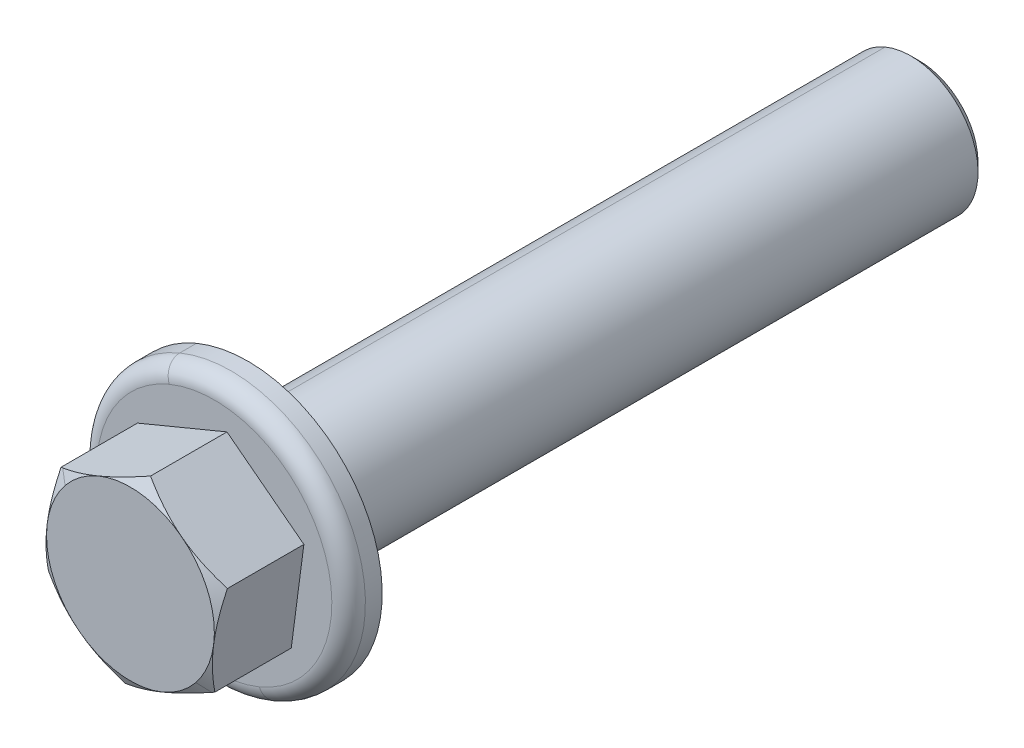
ISO-10303-21;
HEADER;
FILE_DESCRIPTION(('STEP AP214'),'2;1');
FILE_NAME('part.step','',(''),(''),'','','');
FILE_SCHEMA(('AUTOMOTIVE_DESIGN { 1 0 10303 214 1 1 1 1 }'));
ENDSEC;
DATA;
#1=APPLICATION_CONTEXT('core data for automotive mechanical design processes');
#2=APPLICATION_PROTOCOL_DEFINITION('international standard','automotive_design',2000,#1);
#3=PRODUCT_CONTEXT('',#1,'mechanical');
#4=PRODUCT('Part','Part','',(#3));
#5=PRODUCT_RELATED_PRODUCT_CATEGORY('part','',(#4));
#6=PRODUCT_DEFINITION_FORMATION('','',#4);
#7=PRODUCT_DEFINITION_CONTEXT('part definition',#1,'design');
#8=PRODUCT_DEFINITION('design','',#6,#7);
#9=PRODUCT_DEFINITION_SHAPE('','',#8);
#10=(LENGTH_UNIT() NAMED_UNIT(*) SI_UNIT(.MILLI.,.METRE.));
#11=(NAMED_UNIT(*) PLANE_ANGLE_UNIT() SI_UNIT($,.RADIAN.));
#12=(NAMED_UNIT(*) SI_UNIT($,.STERADIAN.) SOLID_ANGLE_UNIT());
#13=UNCERTAINTY_MEASURE_WITH_UNIT(LENGTH_MEASURE(1.E-05),#10,'distance_accuracy_value','');
#14=(GEOMETRIC_REPRESENTATION_CONTEXT(3) GLOBAL_UNCERTAINTY_ASSIGNED_CONTEXT((#13)) GLOBAL_UNIT_ASSIGNED_CONTEXT((#10,
#11,#12)) REPRESENTATION_CONTEXT('',''));
#15=CARTESIAN_POINT('',(0.,0.,0.));
#16=DIRECTION('',(0.,0.,1.));
#17=DIRECTION('',(1.,0.,0.));
#18=AXIS2_PLACEMENT_3D('',#15,#16,#17);
#19=CARTESIAN_POINT('',(-114.,-28.,24.3));
#20=DIRECTION('',(0.,0.,1.));
#21=DIRECTION('',(0.923728021347068,0.383049008063238,0.));
#22=AXIS2_PLACEMENT_3D('',#19,#20,#21);
#23=TOROIDAL_SURFACE('',#22,4.25,0.25);
#24=CARTESIAN_POINT('',(-114.,-28.,24.55));
#25=DIRECTION('',(0.,0.,-1.));
#26=DIRECTION('',(-0.923728021347068,-0.383049008063239,0.));
#27=AXIS2_PLACEMENT_3D('',#24,#25,#26);
#28=CIRCLE('',#27,4.25);
#29=CARTESIAN_POINT('',(-112.372041715731,-31.9258440907251,24.55));
#30=VERTEX_POINT('',#29);
#31=CARTESIAN_POINT('',(-115.627958284269,-24.074155909275,24.55));
#32=VERTEX_POINT('',#31);
#33=EDGE_CURVE('E11',#30,#32,#28,.T.);
#34=ORIENTED_EDGE('',*,*,#33,.T.);
#35=CARTESIAN_POINT('',(-115.627958284269,-24.074155909275,24.3));
#36=DIRECTION('',(0.923728021347068,0.383049008063238,0.));
#37=DIRECTION('',(0.,0.,1.));
#38=AXIS2_PLACEMENT_3D('',#35,#36,#37);
#39=CIRCLE('',#38,0.25);
#40=CARTESIAN_POINT('',(-115.532196032253,-24.3050879146118,24.3));
#41=VERTEX_POINT('',#40);
#42=EDGE_CURVE('E33',#32,#41,#39,.T.);
#43=ORIENTED_EDGE('',*,*,#42,.T.);
#44=CARTESIAN_POINT('',(-114.,-28.,24.3));
#45=DIRECTION('',(0.,0.,-1.));
#46=DIRECTION('',(-0.923728021347068,-0.383049008063238,0.));
#47=AXIS2_PLACEMENT_3D('',#44,#45,#46);
#48=CIRCLE('',#47,4.);
#49=CARTESIAN_POINT('',(-112.467803967747,-31.6949120853883,24.3));
#50=VERTEX_POINT('',#49);
#51=EDGE_CURVE('E461',#50,#41,#48,.T.);
#52=ORIENTED_EDGE('',*,*,#51,.F.);
#53=CARTESIAN_POINT('',(-112.372041715731,-31.9258440907251,24.3));
#54=DIRECTION('',(-0.923728021347068,-0.383049008063238,0.));
#55=DIRECTION('',(0.,0.,1.));
#56=AXIS2_PLACEMENT_3D('',#53,#54,#55);
#57=CIRCLE('',#56,0.25);
#58=EDGE_CURVE('E457',#30,#50,#57,.T.);
#59=ORIENTED_EDGE('',*,*,#58,.F.);
#60=EDGE_LOOP('',(#34,#43,#52,#59));
#61=FACE_BOUND('',#60,.T.);
#62=ADVANCED_FACE('F17',(#61),#23,.F.);
#63=CARTESIAN_POINT('',(-114.,-28.,24.3));
#64=DIRECTION('',(0.,0.,1.));
#65=DIRECTION('',(-0.383049008063238,0.923728021347068,0.));
#66=AXIS2_PLACEMENT_3D('',#63,#64,#65);
#67=TOROIDAL_SURFACE('',#66,4.25,0.25);
#68=CARTESIAN_POINT('',(-114.,-28.,24.55));
#69=DIRECTION('',(0.,0.,-1.));
#70=DIRECTION('',(-0.923728021347068,-0.383049008063239,0.));
#71=AXIS2_PLACEMENT_3D('',#68,#69,#70);
#72=CIRCLE('',#71,4.25);
#73=EDGE_CURVE('E454',#32,#30,#72,.T.);
#74=ORIENTED_EDGE('',*,*,#73,.T.);
#75=ORIENTED_EDGE('',*,*,#58,.T.);
#76=CARTESIAN_POINT('',(-114.,-28.,24.3));
#77=DIRECTION('',(0.,0.,-1.));
#78=DIRECTION('',(-0.923728021347068,-0.383049008063238,0.));
#79=AXIS2_PLACEMENT_3D('',#76,#77,#78);
#80=CIRCLE('',#79,4.);
#81=EDGE_CURVE('E465',#41,#50,#80,.T.);
#82=ORIENTED_EDGE('',*,*,#81,.F.);
#83=ORIENTED_EDGE('',*,*,#42,.F.);
#84=EDGE_LOOP('',(#74,#75,#82,#83));
#85=FACE_BOUND('',#84,.T.);
#86=ADVANCED_FACE('F311',(#85),#67,.F.);
#87=CARTESIAN_POINT('',(-114.,-28.,4.55));
#88=DIRECTION('',(0.,0.,1.));
#89=DIRECTION('',(0.923728021347068,0.383049008063238,0.));
#90=AXIS2_PLACEMENT_3D('',#87,#88,#89);
#91=CYLINDRICAL_SURFACE('',#90,4.);
#92=DIRECTION('',(0.,0.,-1.));
#93=VECTOR('',#92,1.);
#94=CARTESIAN_POINT('',(-112.467803967747,-31.6949120853883,4.55));
#95=LINE('',#94,#93);
#96=CARTESIAN_POINT('',(-112.467803967747,-31.6949120853883,-14.95));
#97=VERTEX_POINT('',#96);
#98=EDGE_CURVE('E468',#50,#97,#95,.T.);
#99=ORIENTED_EDGE('',*,*,#98,.F.);
#100=ORIENTED_EDGE('',*,*,#51,.T.);
#101=DIRECTION('',(0.,0.,-1.));
#102=VECTOR('',#101,1.);
#103=CARTESIAN_POINT('',(-115.532196032253,-24.3050879146118,4.55));
#104=LINE('',#103,#102);
#105=CARTESIAN_POINT('',(-115.532196032253,-24.3050879146118,-14.95));
#106=VERTEX_POINT('',#105);
#107=EDGE_CURVE('E472',#41,#106,#104,.T.);
#108=ORIENTED_EDGE('',*,*,#107,.T.);
#109=CARTESIAN_POINT('',(-114.,-28.,-14.95));
#110=DIRECTION('',(0.,0.,1.));
#111=DIRECTION('',(-0.923728021347068,-0.383049008063238,0.));
#112=AXIS2_PLACEMENT_3D('',#109,#110,#111);
#113=CIRCLE('',#112,4.);
#114=EDGE_CURVE('E467',#106,#97,#113,.T.);
#115=ORIENTED_EDGE('',*,*,#114,.T.);
#116=EDGE_LOOP('',(#99,#100,#108,#115));
#117=FACE_BOUND('',#116,.T.);
#118=ADVANCED_FACE('F317',(#117),#91,.T.);
#119=CARTESIAN_POINT('',(-114.,-28.,4.55));
#120=DIRECTION('',(0.,0.,1.));
#121=DIRECTION('',(0.923728021347068,0.383049008063238,0.));
#122=AXIS2_PLACEMENT_3D('',#119,#120,#121);
#123=CYLINDRICAL_SURFACE('',#122,4.);
#124=ORIENTED_EDGE('',*,*,#107,.F.);
#125=ORIENTED_EDGE('',*,*,#81,.T.);
#126=ORIENTED_EDGE('',*,*,#98,.T.);
#127=CARTESIAN_POINT('',(-114.,-28.,-14.95));
#128=DIRECTION('',(0.,0.,1.));
#129=DIRECTION('',(-0.923728021347068,-0.383049008063238,0.));
#130=AXIS2_PLACEMENT_3D('',#127,#128,#129);
#131=CIRCLE('',#130,4.);
#132=EDGE_CURVE('E471',#97,#106,#131,.T.);
#133=ORIENTED_EDGE('',*,*,#132,.T.);
#134=EDGE_LOOP('',(#124,#125,#126,#133));
#135=FACE_BOUND('',#134,.T.);
#136=ADVANCED_FACE('F322',(#135),#123,.T.);
#137=CARTESIAN_POINT('',(-114.,-28.,-18.95));
#138=DIRECTION('',(0.,0.,1.));
#139=DIRECTION('',(-0.114958388351689,0.993370308066223,0.));
#140=AXIS2_PLACEMENT_3D('',#137,#138,#139);
#141=CONICAL_SURFACE('',#140,0.,0.785398163396999);
#142=DIRECTION('',(0.270856393052956,-0.653174413416782,-0.707106781186537));
#143=VECTOR('',#142,1.);
#144=CARTESIAN_POINT('',(-115.436432941916,-24.5360195723158,-15.2));
#145=LINE('',#144,#143);
#146=CARTESIAN_POINT('',(-115.340671286211,-24.7669518249291,-15.45));
#147=VERTEX_POINT('',#146);
#148=EDGE_CURVE('E478',#106,#147,#145,.T.);
#149=ORIENTED_EDGE('',*,*,#148,.T.);
#150=CARTESIAN_POINT('',(-114.,-28.,-15.45));
#151=DIRECTION('',(0.,0.,1.));
#152=DIRECTION('',(0.993370308066188,0.114958388351986,0.));
#153=AXIS2_PLACEMENT_3D('',#150,#151,#152);
#154=CIRCLE('',#153,3.5);
#155=CARTESIAN_POINT('',(-112.659328471779,-31.2330480747147,-15.45));
#156=VERTEX_POINT('',#155);
#157=EDGE_CURVE('E481',#147,#156,#154,.T.);
#158=ORIENTED_EDGE('',*,*,#157,.T.);
#159=DIRECTION('',(-0.270856551128283,0.65317434786655,-0.707106781186547));
#160=VECTOR('',#159,1.);
#161=CARTESIAN_POINT('',(-112.563566219763,-31.4639800800515,-15.2));
#162=LINE('',#161,#160);
#163=EDGE_CURVE('E484',#97,#156,#162,.T.);
#164=ORIENTED_EDGE('',*,*,#163,.F.);
#165=ORIENTED_EDGE('',*,*,#114,.F.);
#166=EDGE_LOOP('',(#149,#158,#164,#165));
#167=FACE_BOUND('',#166,.T.);
#168=ADVANCED_FACE('F326',(#167),#141,.T.);
#169=CARTESIAN_POINT('',(-114.,-27.9999999999988,-18.95));
#170=DIRECTION('',(-2.07112037355488E-13,-2.99341000002082E-13,1.));
#171=DIRECTION('',(0.383049008063238,-0.923728021347068,-1.97175609173E-13));
#172=AXIS2_PLACEMENT_3D('',#169,#170,#171);
#173=CONICAL_SURFACE('',#172,0.,0.785398163396999);
#174=ORIENTED_EDGE('',*,*,#163,.T.);
#175=CARTESIAN_POINT('',(-114.,-28.,-15.4499999999993));
#176=DIRECTION('',(-2.8263995886347E-13,-1.17204364682804E-13,1.));
#177=DIRECTION('',(0.923728021347068,0.383049008063238,3.05977465587E-13));
#178=AXIS2_PLACEMENT_3D('',#175,#176,#177);
#179=CIRCLE('',#178,3.5);
#180=EDGE_CURVE('E352',#156,#147,#179,.T.);
#181=ORIENTED_EDGE('',*,*,#180,.T.);
#182=ORIENTED_EDGE('',*,*,#148,.F.);
#183=ORIENTED_EDGE('',*,*,#132,.F.);
#184=EDGE_LOOP('',(#174,#181,#182,#183));
#185=FACE_BOUND('',#184,.T.);
#186=ADVANCED_FACE('F330',(#185),#173,.T.);
#187=CARTESIAN_POINT('',(-114.,-28.,-15.45));
#188=DIRECTION('',(0.,0.,1.));
#189=DIRECTION('',(-0.383049008063238,0.923728021347068,0.));
#190=AXIS2_PLACEMENT_3D('',#187,#188,#189);
#191=PLANE('',#190);
#192=ORIENTED_EDGE('',*,*,#180,.F.);
#193=ORIENTED_EDGE('',*,*,#157,.F.);
#194=EDGE_LOOP('',(#192,#193));
#195=FACE_BOUND('',#194,.T.);
#196=ADVANCED_FACE('F334',(#195),#191,.F.);
#197=CARTESIAN_POINT('',(-114.,-28.,31.55));
#198=DIRECTION('',(0.,0.,1.));
#199=DIRECTION('',(0.923728021347068,0.383049008063238,0.));
#200=AXIS2_PLACEMENT_3D('',#197,#198,#199);
#201=PLANE('',#200);
#202=CARTESIAN_POINT('',(-114.,-28.,31.55));
#203=DIRECTION('',(0.,0.,1.));
#204=DIRECTION('',(-0.923728021347068,-0.383049008063239,0.));
#205=AXIS2_PLACEMENT_3D('',#202,#203,#204);
#206=CIRCLE('',#205,5.);
#207=CARTESIAN_POINT('',(-109.04251781647,-28.650669193983,31.5499999999993));
#208=VERTEX_POINT('',#207);
#209=CARTESIAN_POINT('',(-110.957762856788,-24.0320290872444,31.5499999999992));
#210=VERTEX_POINT('',#209);
#211=EDGE_CURVE('E347',#208,#210,#206,.T.);
#212=ORIENTED_EDGE('',*,*,#211,.T.);
#213=CARTESIAN_POINT('',(-114.,-28.,31.55));
#214=DIRECTION('',(0.,0.,1.));
#215=DIRECTION('',(-0.923728021347068,-0.383049008063239,0.));
#216=AXIS2_PLACEMENT_3D('',#213,#214,#215);
#217=CIRCLE('',#216,5.);
#218=CARTESIAN_POINT('',(-115.915245040316,-23.3813598932646,31.55));
#219=VERTEX_POINT('',#218);
#220=EDGE_CURVE('E353',#210,#219,#217,.T.);
#221=ORIENTED_EDGE('',*,*,#220,.T.);
#222=CARTESIAN_POINT('',(-114.,-28.,31.55));
#223=DIRECTION('',(0.,0.,1.));
#224=DIRECTION('',(-0.923728021347068,-0.383049008063239,0.));
#225=AXIS2_PLACEMENT_3D('',#222,#223,#224);
#226=CIRCLE('',#225,5.);
#227=CARTESIAN_POINT('',(-117.895079669917,-24.8649793676956,31.55));
#228=VERTEX_POINT('',#227);
#229=EDGE_CURVE('E368',#219,#228,#226,.T.);
#230=ORIENTED_EDGE('',*,*,#229,.T.);
#231=CARTESIAN_POINT('',(-114.,-28.,31.55));
#232=DIRECTION('',(0.,0.,1.));
#233=DIRECTION('',(-0.923728021347068,-0.383049008063239,0.));
#234=AXIS2_PLACEMENT_3D('',#231,#232,#233);
#235=CIRCLE('',#234,5.);
#236=CARTESIAN_POINT('',(-118.95748218353,-27.3493308060171,31.5499999999993));
#237=VERTEX_POINT('',#236);
#238=EDGE_CURVE('E372',#228,#237,#235,.T.);
#239=ORIENTED_EDGE('',*,*,#238,.T.);
#240=CARTESIAN_POINT('',(-114.,-28.,31.55));
#241=DIRECTION('',(0.,0.,1.));
#242=DIRECTION('',(-0.923728021347068,-0.383049008063239,0.));
#243=AXIS2_PLACEMENT_3D('',#240,#241,#242);
#244=CIRCLE('',#243,5.);
#245=CARTESIAN_POINT('',(-117.042237143212,-31.9679709127556,31.5499999999992));
#246=VERTEX_POINT('',#245);
#247=EDGE_CURVE('E172',#237,#246,#244,.T.);
#248=ORIENTED_EDGE('',*,*,#247,.T.);
#249=CARTESIAN_POINT('',(-114.,-28.,31.55));
#250=DIRECTION('',(0.,0.,1.));
#251=DIRECTION('',(-0.923728021347068,-0.383049008063239,0.));
#252=AXIS2_PLACEMENT_3D('',#249,#250,#251);
#253=CIRCLE('',#252,5.);
#254=CARTESIAN_POINT('',(-112.084754959684,-32.6186401067354,31.55));
#255=VERTEX_POINT('',#254);
#256=EDGE_CURVE('E147',#246,#255,#253,.T.);
#257=ORIENTED_EDGE('',*,*,#256,.T.);
#258=CARTESIAN_POINT('',(-114.,-28.,31.55));
#259=DIRECTION('',(0.,0.,1.));
#260=DIRECTION('',(-0.923728021347068,-0.383049008063239,0.));
#261=AXIS2_PLACEMENT_3D('',#258,#259,#260);
#262=CIRCLE('',#261,5.);
#263=CARTESIAN_POINT('',(-110.104920330083,-31.1350206323045,31.55));
#264=VERTEX_POINT('',#263);
#265=EDGE_CURVE('E160',#255,#264,#262,.T.);
#266=ORIENTED_EDGE('',*,*,#265,.T.);
#267=CARTESIAN_POINT('',(-114.,-28.,31.55));
#268=DIRECTION('',(0.,0.,1.));
#269=DIRECTION('',(-0.923728021347068,-0.383049008063239,0.));
#270=AXIS2_PLACEMENT_3D('',#267,#268,#269);
#271=CIRCLE('',#270,5.);
#272=EDGE_CURVE('E166',#264,#208,#271,.T.);
#273=ORIENTED_EDGE('',*,*,#272,.T.);
#274=EDGE_LOOP('',(#212,#221,#230,#239,#248,#257,#266,#273));
#275=FACE_BOUND('',#274,.T.);
#276=ADVANCED_FACE('F169',(#275),#201,.T.);
#277=CARTESIAN_POINT('',(-114.,-28.,31.55));
#278=DIRECTION('',(0.,0.,-1.));
#279=DIRECTION('',(0.779015933983816,-0.62700412646116,0.));
#280=AXIS2_PLACEMENT_3D('',#277,#278,#279);
#281=CONICAL_SURFACE('',#280,5.,1.0471975512);
#282=ORIENTED_EDGE('',*,*,#211,.F.);
#283=CARTESIAN_POINT('',(-108.666853782169,-25.788465520816,31.1034180126157));
#284=CARTESIAN_POINT('',(-108.6974326745,-26.0214476802984,31.1712680083951));
#285=CARTESIAN_POINT('',(-108.728256453589,-26.2562956446374,31.2334304503107));
#286=CARTESIAN_POINT('',(-108.790175720334,-26.7280617349025,31.3430527974047));
#287=CARTESIAN_POINT('',(-108.821269048188,-26.964963405202,31.3905854034298));
#288=CARTESIAN_POINT('',(-108.868202485524,-27.3225516874721,31.4489473736347));
#289=CARTESIAN_POINT('',(-108.88390625161,-27.4421994920841,31.4662522919641));
#290=CARTESIAN_POINT('',(-108.915388964113,-27.6820679041195,31.4962074663215));
#291=CARTESIAN_POINT('',(-108.931167908539,-27.8022884963823,31.5088578448603));
#292=CARTESIAN_POINT('',(-108.962859342084,-28.0437471648117,31.5292816727013));
#293=CARTESIAN_POINT('',(-108.978772103959,-28.1649873191298,31.5370303207408));
#294=CARTESIAN_POINT('',(-109.010628922959,-28.4077060678826,31.5474002095296));
#295=CARTESIAN_POINT('',(-109.026572985656,-28.529184704773,31.5500204348121));
#296=CARTESIAN_POINT('',(-109.042517816469,-28.6506691939832,31.5499999999984));
#297=B_SPLINE_CURVE_WITH_KNOTS('',3,(#283,#284,#285,#286,#287,#288,#289,#290,#291,#292,#293,
#294,#295,#296),.UNSPECIFIED.,.F.,.F.,(4,2,2,2,2,2,4),(0.,0.734036658391609,1.46436443241703,
1.83000749078375,2.19564092445866,2.56310985866731,2.93065154716815),.UNSPECIFIED.);
#298=CARTESIAN_POINT('',(-108.666853782168,-25.788465520817,31.1034180126157));
#299=VERTEX_POINT('',#298);
#300=EDGE_CURVE('E218',#299,#208,#297,.T.);
#301=ORIENTED_EDGE('',*,*,#300,.F.);
#302=CARTESIAN_POINT('',(-110.957762856787,-24.0320290872434,31.5499999999984));
#303=CARTESIAN_POINT('',(-110.860526618372,-24.1065799603917,31.5500204348121));
#304=CARTESIAN_POINT('',(-110.763295064156,-24.1811272421717,31.5474002095296));
#305=CARTESIAN_POINT('',(-110.569022871261,-24.3300754310856,31.5370303207408));
#306=CARTESIAN_POINT('',(-110.4719821986,-24.4044763642732,31.5292816727013));
#307=CARTESIAN_POINT('',(-110.278718574549,-24.5526512850197,31.5088578448603));
#308=CARTESIAN_POINT('',(-110.182493959804,-24.626426547869,31.4962074663214));
#309=CARTESIAN_POINT('',(-109.990503177667,-24.773625582694,31.4662522919641));
#310=CARTESIAN_POINT('',(-109.89473702241,-24.8470493453661,31.4489473736346));
#311=CARTESIAN_POINT('',(-109.608523204536,-25.0664890355205,31.3905854034297));
#312=CARTESIAN_POINT('',(-109.418907003785,-25.2118674824806,31.3430527974047));
#313=CARTESIAN_POINT('',(-109.041305218343,-25.5013741855972,31.2334304503107));
#314=CARTESIAN_POINT('',(-108.853332804743,-25.6454923434987,31.1712680083951));
#315=CARTESIAN_POINT('',(-108.666853782168,-25.788465520818,31.1034180126157));
#316=B_SPLINE_CURVE_WITH_KNOTS('',3,(#302,#303,#304,#305,#306,#307,#308,#309,#310,#311,#312,
#313,#314,#315),.UNSPECIFIED.,.F.,.F.,(4,2,2,2,2,2,4),(0.,0.367541688500872,0.73501062270957,
1.10064405638452,1.4662871147513,2.19661488877681,2.93065154716849),.UNSPECIFIED.);
#317=EDGE_CURVE('E234',#210,#299,#316,.T.);
#318=ORIENTED_EDGE('',*,*,#317,.F.);
#319=EDGE_LOOP('',(#282,#301,#318));
#320=FACE_BOUND('',#319,.T.);
#321=ADVANCED_FACE('F248',(#320),#281,.T.);
#322=CARTESIAN_POINT('',(-114.,-28.,31.55));
#323=DIRECTION('',(0.,0.,-1.));
#324=DIRECTION('',(0.779015933983816,-0.62700412646116,0.));
#325=AXIS2_PLACEMENT_3D('',#322,#323,#324);
#326=CONICAL_SURFACE('',#325,5.,1.0471975512);
#327=ORIENTED_EDGE('',*,*,#220,.F.);
#328=CARTESIAN_POINT('',(-113.248671931401,-22.2755926536723,31.1034180126172));
#329=CARTESIAN_POINT('',(-113.062192908827,-22.4185658309913,31.1712680083964));
#330=CARTESIAN_POINT('',(-112.874220495227,-22.5626839888925,31.2334304503118));
#331=CARTESIAN_POINT('',(-112.496618709786,-22.8521906920085,31.3430527974054));
#332=CARTESIAN_POINT('',(-112.307002509036,-22.9975691389684,31.3905854034303));
#333=CARTESIAN_POINT('',(-112.020788691162,-23.2170088291224,31.448947373635));
#334=CARTESIAN_POINT('',(-111.925022535905,-23.2904325917943,31.4662522919644));
#335=CARTESIAN_POINT('',(-111.733031753768,-23.437631626619,31.4962074663216));
#336=CARTESIAN_POINT('',(-111.636807139024,-23.5114068894682,31.5088578448604));
#337=CARTESIAN_POINT('',(-111.443543514973,-23.6595818102143,31.5292816727013));
#338=CARTESIAN_POINT('',(-111.346502842312,-23.7339827434018,31.5370303207408));
#339=CARTESIAN_POINT('',(-111.152230649418,-23.8829309323154,31.5474002095296));
#340=CARTESIAN_POINT('',(-111.054999095202,-23.9574782140952,31.5500204348121));
#341=CARTESIAN_POINT('',(-110.957762856787,-24.0320290872434,31.5499999999984));
#342=B_SPLINE_CURVE_WITH_KNOTS('',3,(#328,#329,#330,#331,#332,#333,#334,#335,#336,#337,#338,
#339,#340,#341),.UNSPECIFIED.,.F.,.F.,(4,2,2,2,2,2,4),(0.,0.734036658390163,1.46436443241415,
1.83000749078017,2.19564092445438,2.56310985866231,2.93065154716241),.UNSPECIFIED.);
#343=CARTESIAN_POINT('',(-113.2486719314,-22.2755926536724,31.1034180126172));
#344=VERTEX_POINT('',#343);
#345=EDGE_CURVE('E225',#344,#210,#342,.T.);
#346=ORIENTED_EDGE('',*,*,#345,.F.);
#347=CARTESIAN_POINT('',(-115.915245040316,-23.3813598932645,31.55));
#348=CARTESIAN_POINT('',(-115.802063971088,-23.3344262772027,31.5500204348137));
#349=CARTESIAN_POINT('',(-115.688888354175,-23.2874949220923,31.5474002095312));
#350=CARTESIAN_POINT('',(-115.462759342281,-23.1937243622535,31.5370303207423));
#351=CARTESIAN_POINT('',(-115.349805907745,-23.146885141123,31.5292816727028));
#352=CARTESIAN_POINT('',(-115.124850850149,-23.0536013934401,31.5088578448618));
#353=CARTESIAN_POINT('',(-115.012847290978,-23.0071560640267,31.4962074663229));
#354=CARTESIAN_POINT('',(-114.789373796339,-22.9144866868163,31.4662522919656));
#355=CARTESIAN_POINT('',(-114.677903874994,-22.8682626448763,31.4489473736361));
#356=CARTESIAN_POINT('',(-114.344756619785,-22.7301140527607,31.3905854034312));
#357=CARTESIAN_POINT('',(-114.12404709118,-22.6385908294214,31.3430527974062));
#358=CARTESIAN_POINT('',(-113.684526038994,-22.4563314422729,31.2334304503122));
#359=CARTESIAN_POINT('',(-113.465729846305,-22.3656016358355,31.1712680083966));
#360=CARTESIAN_POINT('',(-113.248671931399,-22.2755926536725,31.1034180126172));
#361=B_SPLINE_CURVE_WITH_KNOTS('',3,(#347,#348,#349,#350,#351,#352,#353,#354,#355,#356,#357,
#358,#359,#360),.UNSPECIFIED.,.F.,.F.,(4,2,2,2,2,2,4),(0.,0.367541688500744,0.735010622709317,
1.10064405638413,1.46628711475077,2.19661488877602,2.93065154716746),.UNSPECIFIED.);
#362=EDGE_CURVE('E256',#219,#344,#361,.T.);
#363=ORIENTED_EDGE('',*,*,#362,.F.);
#364=EDGE_LOOP('',(#327,#346,#363));
#365=FACE_BOUND('',#364,.T.);
#366=ADVANCED_FACE('F243',(#365),#326,.T.);
#367=CARTESIAN_POINT('',(-114.,-28.,31.55));
#368=DIRECTION('',(0.,0.,-1.));
#369=DIRECTION('',(0.779015933983816,-0.62700412646116,0.));
#370=AXIS2_PLACEMENT_3D('',#367,#368,#369);
#371=CONICAL_SURFACE('',#370,5.,1.0471975512);
#372=DIRECTION('',(0.674647588782705,-0.543001501793055,0.500000000000169));
#373=VECTOR('',#372,1.);
#374=CARTESIAN_POINT('',(-119.633077584585,-23.4661224037524,30.2619216436));
#375=LINE('',#374,#373);
#376=CARTESIAN_POINT('',(-118.438419630321,-24.4276630274513,31.147315717563));
#377=VERTEX_POINT('',#376);
#378=EDGE_CURVE('E359',#377,#228,#375,.T.);
#379=ORIENTED_EDGE('',*,*,#378,.T.);
#380=ORIENTED_EDGE('',*,*,#229,.F.);
#381=CARTESIAN_POINT('',(-118.438419630325,-24.4276630274455,31.1473157175507));
#382=CARTESIAN_POINT('',(-118.232678285198,-24.342346769475,31.2089939702821));
#383=CARTESIAN_POINT('',(-118.025377570047,-24.2563838762071,31.2652901400361));
#384=CARTESIAN_POINT('',(-117.609067092617,-24.0837493866827,31.3643275190329));
#385=CARTESIAN_POINT('',(-117.400069803292,-23.9970829626768,31.4071306974177));
#386=CARTESIAN_POINT('',(-117.084787904736,-23.8663427277683,31.4595623012601));
#387=CARTESIAN_POINT('',(-116.97933737104,-23.8226147890261,31.475082637656));
#388=CARTESIAN_POINT('',(-116.767979572772,-23.7349695156316,31.5019229351795));
#389=CARTESIAN_POINT('',(-116.662072316893,-23.6910521845844,31.5132429759078));
#390=CARTESIAN_POINT('',(-116.449439856387,-23.6028783377413,31.5315033490443));
#391=CARTESIAN_POINT('',(-116.342713135998,-23.5586211933935,31.5384231328081));
#392=CARTESIAN_POINT('',(-116.129074024767,-23.4700299113827,31.5476799879821));
#393=CARTESIAN_POINT('',(-116.022161607216,-23.425695762644,31.5500163340106));
#394=CARTESIAN_POINT('',(-115.915245040316,-23.3813598932645,31.55));
#395=B_SPLINE_CURVE_WITH_KNOTS('',3,(#381,#382,#383,#384,#385,#386,#387,#388,#389,#390,#391,
#392,#393,#394),.UNSPECIFIED.,.F.,.F.,(4,2,2,2,2,2,4),(0.,0.693572709725141,1.38391201165265,
1.729464691356,2.07501082206968,2.42215898329329,2.76936208027107),.UNSPECIFIED.);
#396=EDGE_CURVE('E262',#377,#219,#395,.T.);
#397=ORIENTED_EDGE('',*,*,#396,.F.);
#398=EDGE_LOOP('',(#379,#380,#397));
#399=FACE_BOUND('',#398,.T.);
#400=ADVANCED_FACE('F247',(#399),#371,.T.);
#401=CARTESIAN_POINT('',(-114.,-28.,31.55));
#402=DIRECTION('',(0.,0.,-1.));
#403=DIRECTION('',(0.779015933983816,-0.62700412646116,0.));
#404=AXIS2_PLACEMENT_3D('',#401,#402,#403);
#405=CONICAL_SURFACE('',#404,5.,1.0471975512);
#406=ORIENTED_EDGE('',*,*,#238,.F.);
#407=ORIENTED_EDGE('',*,*,#378,.F.);
#408=CARTESIAN_POINT('',(-118.438419630319,-24.4276630274507,31.1473157175));
#409=CARTESIAN_POINT('',(-118.485599372678,-24.4472273939025,31.1331782382));
#410=CARTESIAN_POINT('',(-118.533382008559,-24.4670417665899,31.1185548376));
#411=CARTESIAN_POINT('',(-118.581818149232,-24.487127132856,31.1034180126));
#412=B_SPLINE_CURVE_WITH_KNOTS('',3,(#408,#409,#410,#411),.UNSPECIFIED.,.F.,.F.,(4,4),(0.,1.),.UNSPECIFIED.);
#413=CARTESIAN_POINT('',(-118.581818149232,-24.4871271328537,31.1034180126081));
#414=VERTEX_POINT('',#413);
#415=EDGE_CURVE('E362',#377,#414,#412,.T.);
#416=ORIENTED_EDGE('',*,*,#415,.T.);
#417=CARTESIAN_POINT('',(-118.957482183531,-27.3493308060169,31.5499999999984));
#418=CARTESIAN_POINT('',(-118.941537352718,-27.2278463168069,31.5500204348121));
#419=CARTESIAN_POINT('',(-118.925593290021,-27.1063676799165,31.5474002095297));
#420=CARTESIAN_POINT('',(-118.893736471021,-26.8636489311638,31.5370303207409));
#421=CARTESIAN_POINT('',(-118.877823709146,-26.7424087768458,31.5292816727013));
#422=CARTESIAN_POINT('',(-118.846132275602,-26.5009501084165,31.5088578448604));
#423=CARTESIAN_POINT('',(-118.830353331175,-26.3807295161538,31.4962074663215));
#424=CARTESIAN_POINT('',(-118.798870618673,-26.1408611041185,31.4662522919642));
#425=CARTESIAN_POINT('',(-118.783166852586,-26.0212132995066,31.4489473736348));
#426=CARTESIAN_POINT('',(-118.736233415251,-25.6636250172367,31.39058540343));
#427=CARTESIAN_POINT('',(-118.705140087396,-25.4267233469373,31.343052797405));
#428=CARTESIAN_POINT('',(-118.643220820652,-24.9549572566725,31.2334304503111));
#429=CARTESIAN_POINT('',(-118.612397041562,-24.7201092923337,31.1712680083955));
#430=CARTESIAN_POINT('',(-118.581818149231,-24.4871271328513,31.1034180126162));
#431=B_SPLINE_CURVE_WITH_KNOTS('',3,(#417,#418,#419,#420,#421,#422,#423,#424,#425,#426,#427,
#428,#429,#430),.UNSPECIFIED.,.F.,.F.,(4,2,2,2,2,2,4),(0.,0.367541688500628,0.735010622709072,
1.10064405638378,1.46628711475029,2.19661488877529,2.93065154716648),.UNSPECIFIED.);
#432=EDGE_CURVE('E287',#237,#414,#431,.T.);
#433=ORIENTED_EDGE('',*,*,#432,.F.);
#434=EDGE_LOOP('',(#406,#407,#416,#433));
#435=FACE_BOUND('',#434,.T.);
#436=ADVANCED_FACE('F297',(#435),#405,.T.);
#437=CARTESIAN_POINT('',(-114.,-28.,31.55));
#438=DIRECTION('',(0.,0.,-1.));
#439=DIRECTION('',(0.779015933983816,-0.62700412646116,0.));
#440=AXIS2_PLACEMENT_3D('',#437,#438,#439);
#441=CONICAL_SURFACE('',#440,5.,1.0471975512);
#442=ORIENTED_EDGE('',*,*,#247,.F.);
#443=CARTESIAN_POINT('',(-119.333146217831,-30.2115344791841,31.1034180126157));
#444=CARTESIAN_POINT('',(-119.3025673255,-29.9785523197016,31.1712680083951));
#445=CARTESIAN_POINT('',(-119.271743546411,-29.7437043553627,31.2334304503107));
#446=CARTESIAN_POINT('',(-119.209824279666,-29.2719382650976,31.3430527974047));
#447=CARTESIAN_POINT('',(-119.178730951812,-29.0350365947981,31.3905854034298));
#448=CARTESIAN_POINT('',(-119.131797514476,-28.677448312528,31.4489473736347));
#449=CARTESIAN_POINT('',(-119.11609374839,-28.557800507916,31.4662522919641));
#450=CARTESIAN_POINT('',(-119.084611035887,-28.3179320958806,31.4962074663215));
#451=CARTESIAN_POINT('',(-119.068832091461,-28.1977115036178,31.5088578448603));
#452=CARTESIAN_POINT('',(-119.037140657916,-27.9562528351884,31.5292816727013));
#453=CARTESIAN_POINT('',(-119.021227896041,-27.8350126808703,31.5370303207408));
#454=CARTESIAN_POINT('',(-118.989371077041,-27.5922939321175,31.5474002095296));
#455=CARTESIAN_POINT('',(-118.973427014344,-27.4708152952271,31.5500204348121));
#456=CARTESIAN_POINT('',(-118.957482183531,-27.3493308060169,31.5499999999984));
#457=B_SPLINE_CURVE_WITH_KNOTS('',3,(#443,#444,#445,#446,#447,#448,#449,#450,#451,#452,#453,
#454,#455,#456),.UNSPECIFIED.,.F.,.F.,(4,2,2,2,2,2,4),(0.,0.734036658391584,1.46436443241697,
1.83000749078369,2.19564092445859,2.56310985866723,2.93065154716805),.UNSPECIFIED.);
#458=CARTESIAN_POINT('',(-119.333146217831,-30.211534479183,31.1034180126157));
#459=VERTEX_POINT('',#458);
#460=EDGE_CURVE('E268',#459,#237,#457,.T.);
#461=ORIENTED_EDGE('',*,*,#460,.F.);
#462=CARTESIAN_POINT('',(-117.042237143213,-31.9679709127567,31.5499999999984));
#463=CARTESIAN_POINT('',(-117.139473381628,-31.8934200396084,31.5500204348121));
#464=CARTESIAN_POINT('',(-117.236704935844,-31.8188727578284,31.5474002095296));
#465=CARTESIAN_POINT('',(-117.430977128739,-31.6699245689145,31.5370303207408));
#466=CARTESIAN_POINT('',(-117.5280178014,-31.5955236357269,31.5292816727013));
#467=CARTESIAN_POINT('',(-117.721281425451,-31.4473487149804,31.5088578448603));
#468=CARTESIAN_POINT('',(-117.817506040196,-31.3735734521311,31.4962074663214));
#469=CARTESIAN_POINT('',(-118.009496822333,-31.2263744173061,31.4662522919641));
#470=CARTESIAN_POINT('',(-118.10526297759,-31.152950654634,31.4489473736346));
#471=CARTESIAN_POINT('',(-118.391476795464,-30.9335109644796,31.3905854034297));
#472=CARTESIAN_POINT('',(-118.581092996215,-30.7881325175194,31.3430527974047));
#473=CARTESIAN_POINT('',(-118.958694781657,-30.4986258144029,31.2334304503106));
#474=CARTESIAN_POINT('',(-119.146667195257,-30.3545076565014,31.171268008395));
#475=CARTESIAN_POINT('',(-119.333146217832,-30.211534479182,31.1034180126157));
#476=B_SPLINE_CURVE_WITH_KNOTS('',3,(#462,#463,#464,#465,#466,#467,#468,#469,#470,#471,#472,
#473,#474,#475),.UNSPECIFIED.,.F.,.F.,(4,2,2,2,2,2,4),(0.,0.36754168850087,0.735010622709581,
1.10064405638454,1.46628711475129,2.1966148887768,2.93065154716847),.UNSPECIFIED.);
#477=EDGE_CURVE('E188',#246,#459,#476,.T.);
#478=ORIENTED_EDGE('',*,*,#477,.F.);
#479=EDGE_LOOP('',(#442,#461,#478));
#480=FACE_BOUND('',#479,.T.);
#481=ADVANCED_FACE('F300',(#480),#441,.T.);
#482=CARTESIAN_POINT('',(-114.,-28.,31.55));
#483=DIRECTION('',(0.,0.,-1.));
#484=DIRECTION('',(0.779015933983816,-0.62700412646116,0.));
#485=AXIS2_PLACEMENT_3D('',#482,#483,#484);
#486=CONICAL_SURFACE('',#485,5.,1.0471975512);
#487=ORIENTED_EDGE('',*,*,#256,.F.);
#488=CARTESIAN_POINT('',(-114.751328068599,-33.7244073463279,31.1034180126172));
#489=CARTESIAN_POINT('',(-114.937807091173,-33.5814341690087,31.1712680083963));
#490=CARTESIAN_POINT('',(-115.125779504773,-33.4373160111075,31.2334304503117));
#491=CARTESIAN_POINT('',(-115.503381290214,-33.1478093079916,31.3430527974054));
#492=CARTESIAN_POINT('',(-115.692997490964,-33.0024308610317,31.3905854034302));
#493=CARTESIAN_POINT('',(-115.979211308838,-32.7829911708777,31.4489473736349));
#494=CARTESIAN_POINT('',(-116.074977464095,-32.7095674082058,31.4662522919643));
#495=CARTESIAN_POINT('',(-116.266968246232,-32.5623683733811,31.4962074663216));
#496=CARTESIAN_POINT('',(-116.363192860976,-32.4885931105319,31.5088578448604));
#497=CARTESIAN_POINT('',(-116.556456485027,-32.3404181897857,31.5292816727013));
#498=CARTESIAN_POINT('',(-116.653497157688,-32.2660172565983,31.5370303207408));
#499=CARTESIAN_POINT('',(-116.847769350582,-32.1170690676847,31.5474002095296));
#500=CARTESIAN_POINT('',(-116.945000904798,-32.0425217859049,31.5500204348121));
#501=CARTESIAN_POINT('',(-117.042237143213,-31.9679709127567,31.5499999999984));
#502=B_SPLINE_CURVE_WITH_KNOTS('',3,(#488,#489,#490,#491,#492,#493,#494,#495,#496,#497,#498,
#499,#500,#501),.UNSPECIFIED.,.F.,.F.,(4,2,2,2,2,2,4),(0.,0.734036658390188,1.46436443241419,
1.83000749078023,2.19564092445442,2.56310985866235,2.93065154716246),.UNSPECIFIED.);
#503=CARTESIAN_POINT('',(-114.7513280686,-33.7244073463277,31.1034180126172));
#504=VERTEX_POINT('',#503);
#505=EDGE_CURVE('E150',#504,#246,#502,.T.);
#506=ORIENTED_EDGE('',*,*,#505,.F.);
#507=CARTESIAN_POINT('',(-112.084754959684,-32.6186401067354,31.55));
#508=CARTESIAN_POINT('',(-112.197936028912,-32.6655737227973,31.5500204348137));
#509=CARTESIAN_POINT('',(-112.311111645825,-32.7125050779077,31.5474002095312));
#510=CARTESIAN_POINT('',(-112.537240657719,-32.8062756377465,31.5370303207423));
#511=CARTESIAN_POINT('',(-112.650194092255,-32.853114858877,31.5292816727028));
#512=CARTESIAN_POINT('',(-112.875149149851,-32.9463986065599,31.5088578448618));
#513=CARTESIAN_POINT('',(-112.987152709022,-32.9928439359733,31.4962074663229));
#514=CARTESIAN_POINT('',(-113.210626203661,-33.0855133131837,31.4662522919656));
#515=CARTESIAN_POINT('',(-113.322096125006,-33.1317373551237,31.4489473736361));
#516=CARTESIAN_POINT('',(-113.655243380215,-33.2698859472393,31.3905854034312));
#517=CARTESIAN_POINT('',(-113.87595290882,-33.3614091705786,31.3430527974062));
#518=CARTESIAN_POINT('',(-114.315473961006,-33.5436685577271,31.2334304503122));
#519=CARTESIAN_POINT('',(-114.534270153695,-33.6343983641645,31.1712680083966));
#520=CARTESIAN_POINT('',(-114.751328068601,-33.7244073463275,31.1034180126172));
#521=B_SPLINE_CURVE_WITH_KNOTS('',3,(#507,#508,#509,#510,#511,#512,#513,#514,#515,#516,#517,
#518,#519,#520),.UNSPECIFIED.,.F.,.F.,(4,2,2,2,2,2,4),(0.,0.367541688500757,0.735010622709331,
1.10064405638415,1.46628711475078,2.19661488877602,2.93065154716746),.UNSPECIFIED.);
#522=EDGE_CURVE('E21',#255,#504,#521,.T.);
#523=ORIENTED_EDGE('',*,*,#522,.F.);
#524=EDGE_LOOP('',(#487,#506,#523));
#525=FACE_BOUND('',#524,.T.);
#526=ADVANCED_FACE('F145',(#525),#486,.T.);
#527=CARTESIAN_POINT('',(-114.,-28.,31.55));
#528=DIRECTION('',(0.,0.,-1.));
#529=DIRECTION('',(0.779015933983816,-0.62700412646116,0.));
#530=AXIS2_PLACEMENT_3D('',#527,#528,#529);
#531=CONICAL_SURFACE('',#530,5.,1.0471975512);
#532=DIRECTION('',(-0.674647588782705,0.543001501793055,0.500000000000169));
#533=VECTOR('',#532,1.);
#534=CARTESIAN_POINT('',(-108.366922415415,-32.5338775962476,30.2619216436));
#535=LINE('',#534,#533);
#536=CARTESIAN_POINT('',(-109.561580369679,-31.5723369725486,31.147315717563));
#537=VERTEX_POINT('',#536);
#538=EDGE_CURVE('E163',#537,#264,#535,.T.);
#539=ORIENTED_EDGE('',*,*,#538,.T.);
#540=ORIENTED_EDGE('',*,*,#265,.F.);
#541=CARTESIAN_POINT('',(-109.561580369675,-31.5723369725545,31.1473157175507));
#542=CARTESIAN_POINT('',(-109.767321714802,-31.657653230525,31.2089939702821));
#543=CARTESIAN_POINT('',(-109.974622429953,-31.743616123793,31.2652901400361));
#544=CARTESIAN_POINT('',(-110.390932907383,-31.9162506133173,31.3643275190329));
#545=CARTESIAN_POINT('',(-110.599930196708,-32.0029170373233,31.4071306974177));
#546=CARTESIAN_POINT('',(-110.915212095264,-32.1336572722318,31.4595623012601));
#547=CARTESIAN_POINT('',(-111.02066262896,-32.1773852109739,31.475082637656));
#548=CARTESIAN_POINT('',(-111.232020427228,-32.2650304843684,31.5019229351795));
#549=CARTESIAN_POINT('',(-111.337927683107,-32.3089478154156,31.5132429759078));
#550=CARTESIAN_POINT('',(-111.550560143613,-32.3971216622587,31.5315033490443));
#551=CARTESIAN_POINT('',(-111.657286864002,-32.4413788066065,31.5384231328081));
#552=CARTESIAN_POINT('',(-111.870925975233,-32.5299700886172,31.5476799879821));
#553=CARTESIAN_POINT('',(-111.977838392784,-32.574304237356,31.5500163340106));
#554=CARTESIAN_POINT('',(-112.084754959684,-32.6186401067354,31.55));
#555=B_SPLINE_CURVE_WITH_KNOTS('',3,(#541,#542,#543,#544,#545,#546,#547,#548,#549,#550,#551,
#552,#553,#554),.UNSPECIFIED.,.F.,.F.,(4,2,2,2,2,2,4),(0.,0.693572709725142,1.38391201165265,
1.72946469135602,2.07501082206967,2.42215898329328,2.76936208027105),.UNSPECIFIED.);
#556=EDGE_CURVE('E155',#537,#255,#555,.T.);
#557=ORIENTED_EDGE('',*,*,#556,.F.);
#558=EDGE_LOOP('',(#539,#540,#557));
#559=FACE_BOUND('',#558,.T.);
#560=ADVANCED_FACE('F161',(#559),#531,.T.);
#561=CARTESIAN_POINT('',(-114.,-28.,31.55));
#562=DIRECTION('',(0.,0.,-1.));
#563=DIRECTION('',(0.779015933983816,-0.62700412646116,0.));
#564=AXIS2_PLACEMENT_3D('',#561,#562,#563);
#565=CONICAL_SURFACE('',#564,5.,1.0471975512);
#566=ORIENTED_EDGE('',*,*,#272,.F.);
#567=ORIENTED_EDGE('',*,*,#538,.F.);
#568=CARTESIAN_POINT('',(-109.561580369681,-31.5723369725492,31.1473157175));
#569=CARTESIAN_POINT('',(-109.514400627322,-31.5527726060974,31.1331782382));
#570=CARTESIAN_POINT('',(-109.466617991441,-31.5329582334101,31.1185548376));
#571=CARTESIAN_POINT('',(-109.418181850768,-31.512872867144,31.1034180126));
#572=B_SPLINE_CURVE_WITH_KNOTS('',3,(#568,#569,#570,#571),.UNSPECIFIED.,.F.,.F.,(4,4),(0.,1.),.UNSPECIFIED.);
#573=CARTESIAN_POINT('',(-109.418181850768,-31.5128728671464,31.1034180126081));
#574=VERTEX_POINT('',#573);
#575=EDGE_CURVE('E178',#537,#574,#572,.T.);
#576=ORIENTED_EDGE('',*,*,#575,.T.);
#577=CARTESIAN_POINT('',(-109.042517816469,-28.6506691939832,31.5499999999984));
#578=CARTESIAN_POINT('',(-109.058462647282,-28.7721536831932,31.5500204348121));
#579=CARTESIAN_POINT('',(-109.074406709979,-28.8936323200836,31.5474002095296));
#580=CARTESIAN_POINT('',(-109.106263528979,-29.1363510688363,31.5370303207409));
#581=CARTESIAN_POINT('',(-109.122176290854,-29.2575912231543,31.5292816727013));
#582=CARTESIAN_POINT('',(-109.153867724398,-29.4990498915836,31.5088578448604));
#583=CARTESIAN_POINT('',(-109.169646668825,-29.6192704838463,31.4962074663215));
#584=CARTESIAN_POINT('',(-109.201129381327,-29.8591388958815,31.4662522919642));
#585=CARTESIAN_POINT('',(-109.216833147414,-29.9787867004935,31.4489473736348));
#586=CARTESIAN_POINT('',(-109.263766584749,-30.3363749827634,31.3905854034299));
#587=CARTESIAN_POINT('',(-109.294859912604,-30.5732766530628,31.343052797405));
#588=CARTESIAN_POINT('',(-109.356779179348,-31.0450427433276,31.233430450311));
#589=CARTESIAN_POINT('',(-109.387602958438,-31.2798907076664,31.1712680083955));
#590=CARTESIAN_POINT('',(-109.418181850769,-31.5128728671488,31.1034180126162));
#591=B_SPLINE_CURVE_WITH_KNOTS('',3,(#577,#578,#579,#580,#581,#582,#583,#584,#585,#586,#587,
#588,#589,#590),.UNSPECIFIED.,.F.,.F.,(4,2,2,2,2,2,4),(0.,0.367541688500625,0.735010622709062,
1.10064405638376,1.46628711475026,2.19661488877526,2.93065154716644),.UNSPECIFIED.);
#592=EDGE_CURVE('E211',#208,#574,#591,.T.);
#593=ORIENTED_EDGE('',*,*,#592,.F.);
#594=EDGE_LOOP('',(#566,#567,#576,#593));
#595=FACE_BOUND('',#594,.T.);
#596=ADVANCED_FACE('F201',(#595),#565,.T.);
#597=CARTESIAN_POINT('',(-109.418181850768,-31.512872867144,24.55));
#598=DIRECTION('',(0.991496436705686,-0.130133838796557,0.));
#599=DIRECTION('',(-0.130133838796557,-0.991496436705686,0.));
#600=AXIS2_PLACEMENT_3D('',#597,#598,#599);
#601=PLANE('',#600);
#602=DIRECTION('',(0.,0.,1.));
#603=VECTOR('',#602,1.);
#604=CARTESIAN_POINT('',(-108.666853782169,-25.7884655208173,28.8267090063));
#605=LINE('',#604,#603);
#606=CARTESIAN_POINT('',(-108.666853782169,-25.7884655208173,26.55));
#607=VERTEX_POINT('',#606);
#608=EDGE_CURVE('E358',#607,#299,#605,.T.);
#609=ORIENTED_EDGE('',*,*,#608,.T.);
#610=ORIENTED_EDGE('',*,*,#300,.T.);
#611=ORIENTED_EDGE('',*,*,#592,.T.);
#612=DIRECTION('',(0.,0.,1.));
#613=VECTOR('',#612,1.);
#614=CARTESIAN_POINT('',(-109.418181850768,-31.512872867144,28.8267090063));
#615=LINE('',#614,#613);
#616=CARTESIAN_POINT('',(-109.418181850768,-31.512872867144,26.55));
#617=VERTEX_POINT('',#616);
#618=EDGE_CURVE('E179',#617,#574,#615,.T.);
#619=ORIENTED_EDGE('',*,*,#618,.F.);
#620=DIRECTION('',(0.130133838796557,0.991496436705686,0.));
#621=VECTOR('',#620,1.);
#622=CARTESIAN_POINT('',(-109.042517816473,-28.6506691939826,26.55));
#623=LINE('',#622,#621);
#624=EDGE_CURVE('E219',#617,#607,#623,.T.);
#625=ORIENTED_EDGE('',*,*,#624,.T.);
#626=EDGE_LOOP('',(#609,#610,#611,#619,#625));
#627=FACE_BOUND('',#626,.T.);
#628=ADVANCED_FACE('F206',(#627),#601,.T.);
#629=CARTESIAN_POINT('',(-108.666853782169,-25.7884655208173,24.55));
#630=DIRECTION('',(0.608447428642302,0.793594182550862,0.));
#631=DIRECTION('',(0.793594182550862,-0.608447428642302,0.));
#632=AXIS2_PLACEMENT_3D('',#629,#630,#631);
#633=PLANE('',#632);
#634=DIRECTION('',(0.,0.,1.));
#635=VECTOR('',#634,1.);
#636=CARTESIAN_POINT('',(-113.248671931401,-22.2755926536733,28.8267090063));
#637=LINE('',#636,#635);
#638=CARTESIAN_POINT('',(-113.248671931401,-22.2755926536733,26.55));
#639=VERTEX_POINT('',#638);
#640=EDGE_CURVE('E233',#639,#344,#637,.T.);
#641=ORIENTED_EDGE('',*,*,#640,.T.);
#642=ORIENTED_EDGE('',*,*,#345,.T.);
#643=ORIENTED_EDGE('',*,*,#317,.T.);
#644=ORIENTED_EDGE('',*,*,#608,.F.);
#645=DIRECTION('',(-0.793594182550862,0.608447428642302,0.));
#646=VECTOR('',#645,1.);
#647=CARTESIAN_POINT('',(-110.95776285679,-24.0320290872472,26.55));
#648=LINE('',#647,#646);
#649=EDGE_CURVE('E386',#607,#639,#648,.T.);
#650=ORIENTED_EDGE('',*,*,#649,.T.);
#651=EDGE_LOOP('',(#641,#642,#643,#644,#650));
#652=FACE_BOUND('',#651,.T.);
#653=ADVANCED_FACE('F240',(#652),#633,.T.);
#654=CARTESIAN_POINT('',(-113.248671931401,-22.2755926536733,24.55));
#655=DIRECTION('',(-0.383049008063238,0.923728021347068,0.));
#656=DIRECTION('',(0.923728021347068,0.383049008063238,0.));
#657=AXIS2_PLACEMENT_3D('',#654,#655,#656);
#658=PLANE('',#657);
#659=DIRECTION('',(0.,0.,1.));
#660=VECTOR('',#659,1.);
#661=CARTESIAN_POINT('',(-118.581818149232,-24.487127132856,28.8267090063));
#662=LINE('',#661,#660);
#663=CARTESIAN_POINT('',(-118.581818149232,-24.487127132856,26.55));
#664=VERTEX_POINT('',#663);
#665=EDGE_CURVE('E383',#664,#414,#662,.T.);
#666=ORIENTED_EDGE('',*,*,#665,.T.);
#667=ORIENTED_EDGE('',*,*,#415,.F.);
#668=ORIENTED_EDGE('',*,*,#396,.T.);
#669=ORIENTED_EDGE('',*,*,#362,.T.);
#670=ORIENTED_EDGE('',*,*,#640,.F.);
#671=DIRECTION('',(-0.923728021347068,-0.383049008063238,0.));
#672=VECTOR('',#671,1.);
#673=CARTESIAN_POINT('',(-115.915245040319,-23.3813598932657,26.55));
#674=LINE('',#673,#672);
#675=EDGE_CURVE('E263',#639,#664,#674,.T.);
#676=ORIENTED_EDGE('',*,*,#675,.T.);
#677=EDGE_LOOP('',(#666,#667,#668,#669,#670,#676));
#678=FACE_BOUND('',#677,.T.);
#679=ADVANCED_FACE('F275',(#678),#658,.T.);
#680=CARTESIAN_POINT('',(-118.581818149232,-24.487127132856,24.55));
#681=DIRECTION('',(-0.991496436705686,0.130133838796557,0.));
#682=DIRECTION('',(0.130133838796557,0.991496436705686,0.));
#683=AXIS2_PLACEMENT_3D('',#680,#681,#682);
#684=PLANE('',#683);
#685=DIRECTION('',(0.,0.,1.));
#686=VECTOR('',#685,1.);
#687=CARTESIAN_POINT('',(-119.333146217831,-30.2115344791828,28.8267090063));
#688=LINE('',#687,#686);
#689=CARTESIAN_POINT('',(-119.333146217831,-30.2115344791828,26.55));
#690=VERTEX_POINT('',#689);
#691=EDGE_CURVE('E387',#690,#459,#688,.T.);
#692=ORIENTED_EDGE('',*,*,#691,.T.);
#693=ORIENTED_EDGE('',*,*,#460,.T.);
#694=ORIENTED_EDGE('',*,*,#432,.T.);
#695=ORIENTED_EDGE('',*,*,#665,.F.);
#696=DIRECTION('',(-0.130133838796557,-0.991496436705686,0.));
#697=VECTOR('',#696,1.);
#698=CARTESIAN_POINT('',(-118.957482183527,-27.3493308060174,26.55));
#699=LINE('',#698,#697);
#700=EDGE_CURVE('E292',#664,#690,#699,.T.);
#701=ORIENTED_EDGE('',*,*,#700,.T.);
#702=EDGE_LOOP('',(#692,#693,#694,#695,#701));
#703=FACE_BOUND('',#702,.T.);
#704=ADVANCED_FACE('F278',(#703),#684,.T.);
#705=CARTESIAN_POINT('',(-119.333146217831,-30.2115344791828,24.55));
#706=DIRECTION('',(-0.608447428642302,-0.793594182550862,0.));
#707=DIRECTION('',(-0.793594182550862,0.608447428642302,0.));
#708=AXIS2_PLACEMENT_3D('',#705,#706,#707);
#709=PLANE('',#708);
#710=DIRECTION('',(0.,0.,1.));
#711=VECTOR('',#710,1.);
#712=CARTESIAN_POINT('',(-114.751328068599,-33.7244073463267,28.8267090063));
#713=LINE('',#712,#711);
#714=CARTESIAN_POINT('',(-114.751328068599,-33.7244073463267,26.55));
#715=VERTEX_POINT('',#714);
#716=EDGE_CURVE('E390',#715,#504,#713,.T.);
#717=ORIENTED_EDGE('',*,*,#716,.T.);
#718=ORIENTED_EDGE('',*,*,#505,.T.);
#719=ORIENTED_EDGE('',*,*,#477,.T.);
#720=ORIENTED_EDGE('',*,*,#691,.F.);
#721=DIRECTION('',(0.793594182550862,-0.608447428642302,0.));
#722=VECTOR('',#721,1.);
#723=CARTESIAN_POINT('',(-117.04223714321,-31.9679709127528,26.55));
#724=LINE('',#723,#722);
#725=EDGE_CURVE('E180',#690,#715,#724,.T.);
#726=ORIENTED_EDGE('',*,*,#725,.T.);
#727=EDGE_LOOP('',(#717,#718,#719,#720,#726));
#728=FACE_BOUND('',#727,.T.);
#729=ADVANCED_FACE('F283',(#728),#709,.T.);
#730=CARTESIAN_POINT('',(-114.751328068599,-33.7244073463267,24.55));
#731=DIRECTION('',(0.383049008063238,-0.923728021347068,0.));
#732=DIRECTION('',(-0.923728021347068,-0.383049008063238,0.));
#733=AXIS2_PLACEMENT_3D('',#730,#731,#732);
#734=PLANE('',#733);
#735=ORIENTED_EDGE('',*,*,#618,.T.);
#736=ORIENTED_EDGE('',*,*,#575,.F.);
#737=ORIENTED_EDGE('',*,*,#556,.T.);
#738=ORIENTED_EDGE('',*,*,#522,.T.);
#739=ORIENTED_EDGE('',*,*,#716,.F.);
#740=DIRECTION('',(0.923728021347068,0.383049008063238,0.));
#741=VECTOR('',#740,1.);
#742=CARTESIAN_POINT('',(-112.084754959681,-32.6186401067342,26.55));
#743=LINE('',#742,#741);
#744=EDGE_CURVE('E156',#715,#617,#743,.T.);
#745=ORIENTED_EDGE('',*,*,#744,.T.);
#746=EDGE_LOOP('',(#735,#736,#737,#738,#739,#745));
#747=FACE_BOUND('',#746,.T.);
#748=ADVANCED_FACE('F176',(#747),#734,.T.);
#749=CARTESIAN_POINT('',(-114.,-28.,24.55));
#750=DIRECTION('',(0.,0.,1.));
#751=DIRECTION('',(-0.383049008063238,0.923728021347068,0.));
#752=AXIS2_PLACEMENT_3D('',#749,#750,#751);
#753=PLANE('',#752);
#754=CARTESIAN_POINT('',(-114.,-28.,24.55));
#755=DIRECTION('',(0.,0.,-1.));
#756=DIRECTION('',(-0.923728021347068,-0.383049008063238,0.));
#757=AXIS2_PLACEMENT_3D('',#754,#755,#756);
#758=CIRCLE('',#757,8.);
#759=CARTESIAN_POINT('',(-110.935607935494,-35.3898241707766,24.55));
#760=VERTEX_POINT('',#759);
#761=CARTESIAN_POINT('',(-117.064392064506,-20.6101758292234,24.55));
#762=VERTEX_POINT('',#761);
#763=EDGE_CURVE('E408',#760,#762,#758,.T.);
#764=ORIENTED_EDGE('',*,*,#763,.T.);
#765=CARTESIAN_POINT('',(-114.,-28.,24.55));
#766=DIRECTION('',(0.,0.,-1.));
#767=DIRECTION('',(-0.923728021347068,-0.383049008063238,0.));
#768=AXIS2_PLACEMENT_3D('',#765,#766,#767);
#769=CIRCLE('',#768,8.);
#770=EDGE_CURVE('E411',#762,#760,#769,.T.);
#771=ORIENTED_EDGE('',*,*,#770,.T.);
#772=EDGE_LOOP('',(#764,#771));
#773=FACE_BOUND('',#772,.T.);
#774=ORIENTED_EDGE('',*,*,#33,.F.);
#775=ORIENTED_EDGE('',*,*,#73,.F.);
#776=EDGE_LOOP('',(#774,#775));
#777=FACE_BOUND('',#776,.T.);
#778=ADVANCED_FACE('F448',(#773,#777),#753,.F.);
#779=CARTESIAN_POINT('',(-114.,-28.,26.55));
#780=DIRECTION('',(0.,0.,-1.));
#781=DIRECTION('',(0.383049008063238,-0.923728021347068,0.));
#782=AXIS2_PLACEMENT_3D('',#779,#780,#781);
#783=PLANE('',#782);
#784=CARTESIAN_POINT('',(-114.,-28.,26.55));
#785=DIRECTION('',(0.,0.,-1.));
#786=DIRECTION('',(0.923728021347068,0.383049008063238,0.));
#787=AXIS2_PLACEMENT_3D('',#784,#785,#786);
#788=CIRCLE('',#787,7.);
#789=CARTESIAN_POINT('',(-116.681343056443,-21.5339038505706,26.55));
#790=VERTEX_POINT('',#789);
#791=CARTESIAN_POINT('',(-111.318656938176,-34.466096147198,26.55));
#792=VERTEX_POINT('',#791);
#793=EDGE_CURVE('E414',#790,#792,#788,.T.);
#794=ORIENTED_EDGE('',*,*,#793,.F.);
#795=CARTESIAN_POINT('',(-114.,-28.,26.55));
#796=DIRECTION('',(0.,0.,-1.));
#797=DIRECTION('',(0.923728021347068,0.383049008063238,0.));
#798=AXIS2_PLACEMENT_3D('',#795,#796,#797);
#799=CIRCLE('',#798,7.);
#800=EDGE_CURVE('E418',#792,#790,#799,.T.);
#801=ORIENTED_EDGE('',*,*,#800,.F.);
#802=EDGE_LOOP('',(#794,#801));
#803=FACE_BOUND('',#802,.T.);
#804=ORIENTED_EDGE('',*,*,#700,.F.);
#805=ORIENTED_EDGE('',*,*,#675,.F.);
#806=ORIENTED_EDGE('',*,*,#649,.F.);
#807=ORIENTED_EDGE('',*,*,#624,.F.);
#808=ORIENTED_EDGE('',*,*,#744,.F.);
#809=ORIENTED_EDGE('',*,*,#725,.F.);
#810=EDGE_LOOP('',(#804,#805,#806,#807,#808,#809));
#811=FACE_BOUND('',#810,.T.);
#812=ADVANCED_FACE('F451',(#803,#811),#783,.F.);
#813=CARTESIAN_POINT('',(-114.,-28.,25.55));
#814=DIRECTION('',(0.,0.,-1.));
#815=DIRECTION('',(-0.923728021347068,-0.383049008063238,0.));
#816=AXIS2_PLACEMENT_3D('',#813,#814,#815);
#817=CYLINDRICAL_SURFACE('',#816,8.);
#818=DIRECTION('',(0.,0.,-1.));
#819=VECTOR('',#818,1.);
#820=CARTESIAN_POINT('',(-117.064392064506,-20.6101758292234,25.55));
#821=LINE('',#820,#819);
#822=CARTESIAN_POINT('',(-117.064392064506,-20.6101758292234,25.55));
#823=VERTEX_POINT('',#822);
#824=EDGE_CURVE('E413',#823,#762,#821,.T.);
#825=ORIENTED_EDGE('',*,*,#824,.T.);
#826=ORIENTED_EDGE('',*,*,#763,.F.);
#827=DIRECTION('',(0.,0.,-1.));
#828=VECTOR('',#827,1.);
#829=CARTESIAN_POINT('',(-110.935607935494,-35.3898241707766,25.55));
#830=LINE('',#829,#828);
#831=CARTESIAN_POINT('',(-110.935607935494,-35.3898241707766,25.55));
#832=VERTEX_POINT('',#831);
#833=EDGE_CURVE('E425',#832,#760,#830,.T.);
#834=ORIENTED_EDGE('',*,*,#833,.F.);
#835=CARTESIAN_POINT('',(-114.,-28.,25.55));
#836=DIRECTION('',(0.,0.,-1.));
#837=DIRECTION('',(0.923728021347068,0.383049008063238,0.));
#838=AXIS2_PLACEMENT_3D('',#835,#836,#837);
#839=CIRCLE('',#838,8.);
#840=EDGE_CURVE('E424',#832,#823,#839,.T.);
#841=ORIENTED_EDGE('',*,*,#840,.T.);
#842=EDGE_LOOP('',(#825,#826,#834,#841));
#843=FACE_BOUND('',#842,.T.);
#844=ADVANCED_FACE('F444',(#843),#817,.T.);
#845=CARTESIAN_POINT('',(-114.,-28.,25.55));
#846=DIRECTION('',(0.,0.,-1.));
#847=DIRECTION('',(-0.923728021347068,-0.383049008063238,0.));
#848=AXIS2_PLACEMENT_3D('',#845,#846,#847);
#849=CYLINDRICAL_SURFACE('',#848,8.);
#850=ORIENTED_EDGE('',*,*,#833,.T.);
#851=ORIENTED_EDGE('',*,*,#770,.F.);
#852=ORIENTED_EDGE('',*,*,#824,.F.);
#853=CARTESIAN_POINT('',(-114.,-28.,25.55));
#854=DIRECTION('',(0.,0.,-1.));
#855=DIRECTION('',(0.923728021347068,0.383049008063238,0.));
#856=AXIS2_PLACEMENT_3D('',#853,#854,#855);
#857=CIRCLE('',#856,8.);
#858=EDGE_CURVE('E421',#823,#832,#857,.T.);
#859=ORIENTED_EDGE('',*,*,#858,.T.);
#860=EDGE_LOOP('',(#850,#851,#852,#859));
#861=FACE_BOUND('',#860,.T.);
#862=ADVANCED_FACE('F446',(#861),#849,.T.);
#863=CARTESIAN_POINT('',(-114.,-28.,25.55));
#864=DIRECTION('',(0.,0.,-1.));
#865=DIRECTION('',(-0.685304797594587,0.728256365845052,0.));
#866=AXIS2_PLACEMENT_3D('',#863,#864,#865);
#867=TOROIDAL_SURFACE('',#866,7.,1.);
#868=CARTESIAN_POINT('',(-111.318656820479,-34.4660960983918,25.55));
#869=DIRECTION('',(0.923728014055973,0.383049025645815,0.));
#870=DIRECTION('',(0.,0.,1.));
#871=AXIS2_PLACEMENT_3D('',#868,#869,#870);
#872=CIRCLE('',#871,1.);
#873=EDGE_CURVE('E417',#792,#832,#872,.T.);
#874=ORIENTED_EDGE('',*,*,#873,.F.);
#875=ORIENTED_EDGE('',*,*,#800,.T.);
#876=CARTESIAN_POINT('',(-116.681343056443,-21.5339038505706,25.55));
#877=DIRECTION('',(-0.923728021347068,-0.383049008063238,0.));
#878=DIRECTION('',(0.,0.,1.));
#879=AXIS2_PLACEMENT_3D('',#876,#877,#878);
#880=CIRCLE('',#879,1.);
#881=EDGE_CURVE('E416',#790,#823,#880,.T.);
#882=ORIENTED_EDGE('',*,*,#881,.T.);
#883=ORIENTED_EDGE('',*,*,#840,.F.);
#884=EDGE_LOOP('',(#874,#875,#882,#883));
#885=FACE_BOUND('',#884,.T.);
#886=ADVANCED_FACE('F437',(#885),#867,.T.);
#887=CARTESIAN_POINT('',(-114.,-28.,25.55));
#888=DIRECTION('',(0.,0.,-1.));
#889=DIRECTION('',(0.383049008063237,-0.923728021347068,0.));
#890=AXIS2_PLACEMENT_3D('',#887,#888,#889);
#891=TOROIDAL_SURFACE('',#890,7.,1.);
#892=ORIENTED_EDGE('',*,*,#881,.F.);
#893=ORIENTED_EDGE('',*,*,#793,.T.);
#894=ORIENTED_EDGE('',*,*,#873,.T.);
#895=ORIENTED_EDGE('',*,*,#858,.F.);
#896=EDGE_LOOP('',(#892,#893,#894,#895));
#897=FACE_BOUND('',#896,.T.);
#898=ADVANCED_FACE('F19',(#897),#891,.T.);
#899=CLOSED_SHELL('',(#62,#86,#118,#136,#168,#186,#196,#276,#321,#366,#400,#436,#481,#526,#560,
#596,#628,#653,#679,#704,#729,#748,#778,#812,#844,#862,#886,#898));
#900=MANIFOLD_SOLID_BREP('B1',#899);
#901=ADVANCED_BREP_SHAPE_REPRESENTATION('',(#18,#900),#14);
#902=SHAPE_DEFINITION_REPRESENTATION(#9,#901);
ENDSEC;
END-ISO-10303-21;
